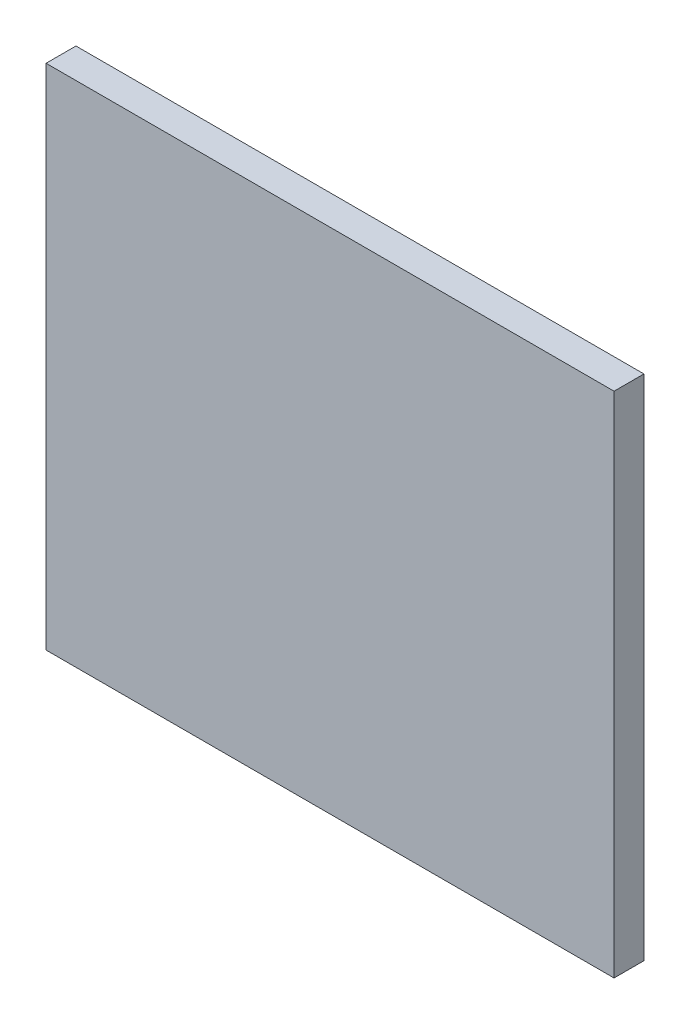
ISO-10303-21;
HEADER;
FILE_DESCRIPTION(('STEP AP214'),'2;1');
FILE_NAME('part.step','',(''),(''),'','','');
FILE_SCHEMA(('AUTOMOTIVE_DESIGN { 1 0 10303 214 1 1 1 1 }'));
ENDSEC;
DATA;
#1=APPLICATION_CONTEXT('core data for automotive mechanical design processes');
#2=APPLICATION_PROTOCOL_DEFINITION('international standard','automotive_design',2000,#1);
#3=PRODUCT_CONTEXT('',#1,'mechanical');
#4=PRODUCT('Part','Part','',(#3));
#5=PRODUCT_RELATED_PRODUCT_CATEGORY('part','',(#4));
#6=PRODUCT_DEFINITION_FORMATION('','',#4);
#7=PRODUCT_DEFINITION_CONTEXT('part definition',#1,'design');
#8=PRODUCT_DEFINITION('design','',#6,#7);
#9=PRODUCT_DEFINITION_SHAPE('','',#8);
#10=(LENGTH_UNIT() NAMED_UNIT(*) SI_UNIT(.MILLI.,.METRE.));
#11=(NAMED_UNIT(*) PLANE_ANGLE_UNIT() SI_UNIT($,.RADIAN.));
#12=(NAMED_UNIT(*) SI_UNIT($,.STERADIAN.) SOLID_ANGLE_UNIT());
#13=UNCERTAINTY_MEASURE_WITH_UNIT(LENGTH_MEASURE(1.E-05),#10,'distance_accuracy_value','');
#14=(GEOMETRIC_REPRESENTATION_CONTEXT(3) GLOBAL_UNCERTAINTY_ASSIGNED_CONTEXT((#13)) GLOBAL_UNIT_ASSIGNED_CONTEXT((#10,
#11,#12)) REPRESENTATION_CONTEXT('',''));
#15=CARTESIAN_POINT('',(0.,0.,0.));
#16=DIRECTION('',(0.,0.,1.));
#17=DIRECTION('',(1.,0.,0.));
#18=AXIS2_PLACEMENT_3D('',#15,#16,#17);
#19=CARTESIAN_POINT('',(-0.475,-0.425,0.45));
#20=DIRECTION('',(0.,0.,-1.));
#21=DIRECTION('',(0.,-1.,0.));
#22=AXIS2_PLACEMENT_3D('',#19,#20,#21);
#23=PLANE('',#22);
#24=DIRECTION('',(-1.,0.,0.));
#25=VECTOR('',#24,1.);
#26=CARTESIAN_POINT('',(-0.625,-0.425,0.45));
#27=LINE('',#26,#25);
#28=CARTESIAN_POINT('',(0.475,-0.425,0.45));
#29=VERTEX_POINT('',#28);
#30=CARTESIAN_POINT('',(-0.475,-0.425,0.45));
#31=VERTEX_POINT('',#30);
#32=EDGE_CURVE('E11',#29,#31,#27,.T.);
#33=ORIENTED_EDGE('',*,*,#32,.T.);
#34=DIRECTION('',(0.,-1.,0.));
#35=VECTOR('',#34,1.);
#36=CARTESIAN_POINT('',(-0.475,0.425,0.45));
#37=LINE('',#36,#35);
#38=CARTESIAN_POINT('',(-0.475,0.425,0.45));
#39=VERTEX_POINT('',#38);
#40=EDGE_CURVE('E21',#39,#31,#37,.T.);
#41=ORIENTED_EDGE('',*,*,#40,.F.);
#42=DIRECTION('',(1.,0.,0.));
#43=VECTOR('',#42,1.);
#44=CARTESIAN_POINT('',(0.15,0.425,0.45));
#45=LINE('',#44,#43);
#46=CARTESIAN_POINT('',(0.475,0.425,0.45));
#47=VERTEX_POINT('',#46);
#48=EDGE_CURVE('E28',#39,#47,#45,.T.);
#49=ORIENTED_EDGE('',*,*,#48,.T.);
#50=DIRECTION('',(0.,1.,0.));
#51=VECTOR('',#50,1.);
#52=CARTESIAN_POINT('',(0.475,0.425,0.45));
#53=LINE('',#52,#51);
#54=EDGE_CURVE('E80',#29,#47,#53,.T.);
#55=ORIENTED_EDGE('',*,*,#54,.F.);
#56=EDGE_LOOP('',(#33,#41,#49,#55));
#57=FACE_BOUND('',#56,.T.);
#58=ADVANCED_FACE('F17',(#57),#23,.T.);
#59=CARTESIAN_POINT('',(0.775,0.425,0.));
#60=DIRECTION('',(0.,1.,0.));
#61=DIRECTION('',(1.,0.,0.));
#62=AXIS2_PLACEMENT_3D('',#59,#60,#61);
#63=PLANE('',#62);
#64=ORIENTED_EDGE('',*,*,#48,.F.);
#65=DIRECTION('',(0.,0.,-1.));
#66=VECTOR('',#65,1.);
#67=CARTESIAN_POINT('',(-0.475,0.425,0.2));
#68=LINE('',#67,#66);
#69=CARTESIAN_POINT('',(-0.475,0.425,0.5));
#70=VERTEX_POINT('',#69);
#71=EDGE_CURVE('E99',#70,#39,#68,.T.);
#72=ORIENTED_EDGE('',*,*,#71,.F.);
#73=DIRECTION('',(-1.,0.,0.));
#74=VECTOR('',#73,1.);
#75=CARTESIAN_POINT('',(0.775,0.425,0.5));
#76=LINE('',#75,#74);
#77=CARTESIAN_POINT('',(0.475,0.425,0.5));
#78=VERTEX_POINT('',#77);
#79=EDGE_CURVE('E74',#78,#70,#76,.T.);
#80=ORIENTED_EDGE('',*,*,#79,.F.);
#81=DIRECTION('',(0.,0.,1.));
#82=VECTOR('',#81,1.);
#83=CARTESIAN_POINT('',(0.475,0.425,0.25));
#84=LINE('',#83,#82);
#85=EDGE_CURVE('E87',#47,#78,#84,.T.);
#86=ORIENTED_EDGE('',*,*,#85,.F.);
#87=EDGE_LOOP('',(#64,#72,#80,#86));
#88=FACE_BOUND('',#87,.T.);
#89=ADVANCED_FACE('F112',(#88),#63,.T.);
#90=CARTESIAN_POINT('',(-0.475,0.425,0.4));
#91=DIRECTION('',(-1.,0.,0.));
#92=DIRECTION('',(0.,1.,0.));
#93=AXIS2_PLACEMENT_3D('',#90,#91,#92);
#94=PLANE('',#93);
#95=DIRECTION('',(0.,0.,1.));
#96=VECTOR('',#95,1.);
#97=CARTESIAN_POINT('',(-0.475,-0.425,0.2));
#98=LINE('',#97,#96);
#99=CARTESIAN_POINT('',(-0.475,-0.425,0.5));
#100=VERTEX_POINT('',#99);
#101=EDGE_CURVE('E92',#31,#100,#98,.T.);
#102=ORIENTED_EDGE('',*,*,#101,.T.);
#103=DIRECTION('',(0.,1.,0.));
#104=VECTOR('',#103,1.);
#105=CARTESIAN_POINT('',(-0.475,0.2125,0.5));
#106=LINE('',#105,#104);
#107=EDGE_CURVE('E57',#100,#70,#106,.T.);
#108=ORIENTED_EDGE('',*,*,#107,.T.);
#109=ORIENTED_EDGE('',*,*,#71,.T.);
#110=ORIENTED_EDGE('',*,*,#40,.T.);
#111=EDGE_LOOP('',(#102,#108,#109,#110));
#112=FACE_BOUND('',#111,.T.);
#113=ADVANCED_FACE('F19',(#112),#94,.T.);
#114=CARTESIAN_POINT('',(0.475,0.425,0.5));
#115=DIRECTION('',(1.,0.,0.));
#116=DIRECTION('',(0.,1.,0.));
#117=AXIS2_PLACEMENT_3D('',#114,#115,#116);
#118=PLANE('',#117);
#119=DIRECTION('',(0.,0.,-1.));
#120=VECTOR('',#119,1.);
#121=CARTESIAN_POINT('',(0.475,-0.425,0.25));
#122=LINE('',#121,#120);
#123=CARTESIAN_POINT('',(0.475,-0.425,0.5));
#124=VERTEX_POINT('',#123);
#125=EDGE_CURVE('E86',#124,#29,#122,.T.);
#126=ORIENTED_EDGE('',*,*,#125,.T.);
#127=ORIENTED_EDGE('',*,*,#54,.T.);
#128=ORIENTED_EDGE('',*,*,#85,.T.);
#129=DIRECTION('',(0.,-1.,0.));
#130=VECTOR('',#129,1.);
#131=CARTESIAN_POINT('',(0.475,0.2125,0.5));
#132=LINE('',#131,#130);
#133=EDGE_CURVE('E70',#78,#124,#132,.T.);
#134=ORIENTED_EDGE('',*,*,#133,.T.);
#135=EDGE_LOOP('',(#126,#127,#128,#134));
#136=FACE_BOUND('',#135,.T.);
#137=ADVANCED_FACE('F93',(#136),#118,.T.);
#138=CARTESIAN_POINT('',(0.,0.,0.5));
#139=DIRECTION('',(0.,0.,1.));
#140=DIRECTION('',(1.,0.,0.));
#141=AXIS2_PLACEMENT_3D('',#138,#139,#140);
#142=PLANE('',#141);
#143=ORIENTED_EDGE('',*,*,#133,.F.);
#144=ORIENTED_EDGE('',*,*,#79,.T.);
#145=ORIENTED_EDGE('',*,*,#107,.F.);
#146=DIRECTION('',(1.,0.,0.));
#147=VECTOR('',#146,1.);
#148=CARTESIAN_POINT('',(-0.775,-0.425,0.5));
#149=LINE('',#148,#147);
#150=EDGE_CURVE('E118',#100,#124,#149,.T.);
#151=ORIENTED_EDGE('',*,*,#150,.T.);
#152=EDGE_LOOP('',(#143,#144,#145,#151));
#153=FACE_BOUND('',#152,.T.);
#154=ADVANCED_FACE('F125',(#153),#142,.T.);
#155=CARTESIAN_POINT('',(-0.775,-0.425,0.));
#156=DIRECTION('',(0.,-1.,0.));
#157=DIRECTION('',(0.,0.,-1.));
#158=AXIS2_PLACEMENT_3D('',#155,#156,#157);
#159=PLANE('',#158);
#160=ORIENTED_EDGE('',*,*,#32,.F.);
#161=ORIENTED_EDGE('',*,*,#125,.F.);
#162=ORIENTED_EDGE('',*,*,#150,.F.);
#163=ORIENTED_EDGE('',*,*,#101,.F.);
#164=EDGE_LOOP('',(#160,#161,#162,#163));
#165=FACE_BOUND('',#164,.T.);
#166=ADVANCED_FACE('F90',(#165),#159,.T.);
#167=CLOSED_SHELL('',(#58,#89,#113,#137,#154,#166));
#168=MANIFOLD_SOLID_BREP('B1',#167);
#169=ADVANCED_BREP_SHAPE_REPRESENTATION('',(#18,#168),#14);
#170=SHAPE_DEFINITION_REPRESENTATION(#9,#169);
ENDSEC;
END-ISO-10303-21;
